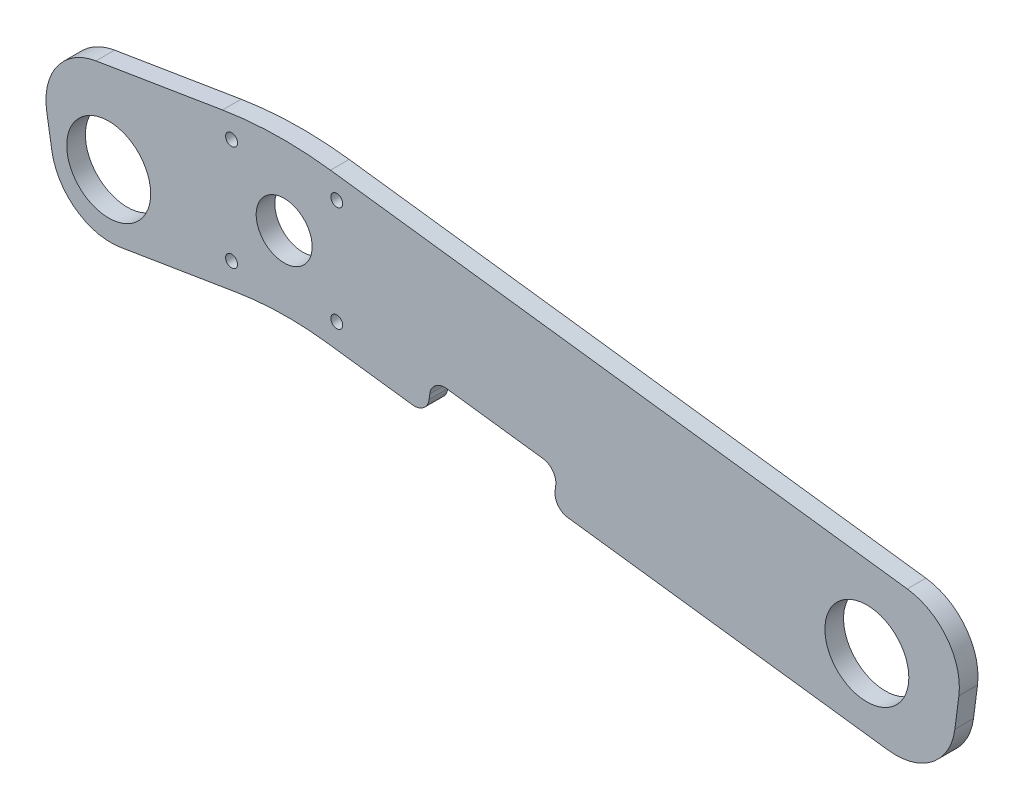
ISO-10303-21;
HEADER;
FILE_DESCRIPTION(('STEP AP214'),'2;1');
FILE_NAME('part.step','',(''),(''),'','','');
FILE_SCHEMA(('AUTOMOTIVE_DESIGN { 1 0 10303 214 1 1 1 1 }'));
ENDSEC;
DATA;
#1=APPLICATION_CONTEXT('core data for automotive mechanical design processes');
#2=APPLICATION_PROTOCOL_DEFINITION('international standard','automotive_design',2000,#1);
#3=PRODUCT_CONTEXT('',#1,'mechanical');
#4=PRODUCT('Part','Part','',(#3));
#5=PRODUCT_RELATED_PRODUCT_CATEGORY('part','',(#4));
#6=PRODUCT_DEFINITION_FORMATION('','',#4);
#7=PRODUCT_DEFINITION_CONTEXT('part definition',#1,'design');
#8=PRODUCT_DEFINITION('design','',#6,#7);
#9=PRODUCT_DEFINITION_SHAPE('','',#8);
#10=(LENGTH_UNIT() NAMED_UNIT(*) SI_UNIT(.MILLI.,.METRE.));
#11=(NAMED_UNIT(*) PLANE_ANGLE_UNIT() SI_UNIT($,.RADIAN.));
#12=(NAMED_UNIT(*) SI_UNIT($,.STERADIAN.) SOLID_ANGLE_UNIT());
#13=UNCERTAINTY_MEASURE_WITH_UNIT(LENGTH_MEASURE(1.E-05),#10,'distance_accuracy_value','');
#14=(GEOMETRIC_REPRESENTATION_CONTEXT(3) GLOBAL_UNCERTAINTY_ASSIGNED_CONTEXT((#13)) GLOBAL_UNIT_ASSIGNED_CONTEXT((#10,
#11,#12)) REPRESENTATION_CONTEXT('',''));
#15=CARTESIAN_POINT('',(0.,0.,0.));
#16=DIRECTION('',(0.,0.,1.));
#17=DIRECTION('',(1.,0.,0.));
#18=AXIS2_PLACEMENT_3D('',#15,#16,#17);
#19=CARTESIAN_POINT('',(-347.342471816428,-103.975661033452,6.35));
#20=DIRECTION('',(0.127692072022815,0.991813860934863,0.));
#21=DIRECTION('',(-0.991813860934863,0.127692072022815,0.));
#22=AXIS2_PLACEMENT_3D('',#19,#20,#21);
#23=PLANE('',#22);
#24=DIRECTION('',(0.991813860934863,-0.127692072022815,0.));
#25=VECTOR('',#24,1.);
#26=CARTESIAN_POINT('',(-347.342471816428,-103.975661033452,0.));
#27=LINE('',#26,#25);
#28=CARTESIAN_POINT('',(-331.859027890658,-105.969092578225,0.));
#29=VERTEX_POINT('',#28);
#30=CARTESIAN_POINT('',(-302.809602063347,-109.709090092947,0.));
#31=VERTEX_POINT('',#30);
#32=EDGE_CURVE('E342',#29,#31,#27,.T.);
#33=ORIENTED_EDGE('',*,*,#32,.T.);
#34=DIRECTION('',(0.,0.,1.));
#35=VECTOR('',#34,1.);
#36=CARTESIAN_POINT('',(-302.809602063347,-109.709090092947,6.35));
#37=LINE('',#36,#35);
#38=CARTESIAN_POINT('',(-302.809602063347,-109.709090092947,6.35));
#39=VERTEX_POINT('',#38);
#40=EDGE_CURVE('E265',#31,#39,#37,.T.);
#41=ORIENTED_EDGE('',*,*,#40,.T.);
#42=DIRECTION('',(0.991813860934863,-0.127692072022815,0.));
#43=VECTOR('',#42,1.);
#44=CARTESIAN_POINT('',(-347.342471816428,-103.975661033452,6.35));
#45=LINE('',#44,#43);
#46=CARTESIAN_POINT('',(-331.859027890658,-105.969092578225,6.35));
#47=VERTEX_POINT('',#46);
#48=EDGE_CURVE('E327',#47,#39,#45,.T.);
#49=ORIENTED_EDGE('',*,*,#48,.F.);
#50=DIRECTION('',(0.,0.,-1.));
#51=VECTOR('',#50,1.);
#52=CARTESIAN_POINT('',(-331.859027890658,-105.969092578225,0.));
#53=LINE('',#52,#51);
#54=EDGE_CURVE('E247',#47,#29,#53,.T.);
#55=ORIENTED_EDGE('',*,*,#54,.T.);
#56=EDGE_LOOP('',(#33,#41,#49,#55));
#57=FACE_BOUND('',#56,.T.);
#58=ADVANCED_FACE('F34',(#57),#23,.F.);
#59=CARTESIAN_POINT('',(-430.595798313536,-65.4640399700101,6.35));
#60=DIRECTION('',(0.986814610332769,0.161854641063473,0.));
#61=DIRECTION('',(-0.161854641063473,0.986814610332769,0.));
#62=AXIS2_PLACEMENT_3D('',#59,#60,#61);
#63=PLANE('',#62);
#64=DIRECTION('',(0.161854641063473,-0.986814610332769,0.));
#65=VECTOR('',#64,1.);
#66=CARTESIAN_POINT('',(-430.595798313536,-65.4640399700101,0.));
#67=LINE('',#66,#65);
#68=CARTESIAN_POINT('',(-427.306912007127,-85.516112851972,0.));
#69=VERTEX_POINT('',#68);
#70=CARTESIAN_POINT('',(-425.552607165953,-96.2119670880483,0.));
#71=VERTEX_POINT('',#70);
#72=EDGE_CURVE('E334',#69,#71,#67,.T.);
#73=ORIENTED_EDGE('',*,*,#72,.T.);
#74=DIRECTION('',(0.,0.,-1.));
#75=VECTOR('',#74,1.);
#76=CARTESIAN_POINT('',(-425.552607165953,-96.2119670880483,6.35));
#77=LINE('',#76,#75);
#78=CARTESIAN_POINT('',(-425.552607165953,-96.2119670880483,6.35));
#79=VERTEX_POINT('',#78);
#80=EDGE_CURVE('E221',#71,#79,#77,.F.);
#81=ORIENTED_EDGE('',*,*,#80,.T.);
#82=DIRECTION('',(0.161854641063473,-0.986814610332769,0.));
#83=VECTOR('',#82,1.);
#84=CARTESIAN_POINT('',(-430.595798313536,-65.4640399700101,6.35));
#85=LINE('',#84,#83);
#86=CARTESIAN_POINT('',(-427.306912007127,-85.516112851972,6.35));
#87=VERTEX_POINT('',#86);
#88=EDGE_CURVE('E195',#87,#79,#85,.T.);
#89=ORIENTED_EDGE('',*,*,#88,.F.);
#90=DIRECTION('',(0.,0.,-1.));
#91=VECTOR('',#90,1.);
#92=CARTESIAN_POINT('',(-427.306912007127,-85.516112851972,6.35));
#93=LINE('',#92,#91);
#94=EDGE_CURVE('E208',#87,#69,#93,.T.);
#95=ORIENTED_EDGE('',*,*,#94,.T.);
#96=EDGE_LOOP('',(#73,#81,#89,#95));
#97=FACE_BOUND('',#96,.T.);
#98=ADVANCED_FACE('F363',(#97),#63,.F.);
#99=CARTESIAN_POINT('',(-422.263720859543,-116.26403997001,6.35));
#100=DIRECTION('',(-0.161854641063474,0.986814610332769,0.));
#101=DIRECTION('',(-0.986814610332769,-0.161854641063474,0.));
#102=AXIS2_PLACEMENT_3D('',#99,#100,#101);
#103=PLANE('',#102);
#104=DIRECTION('',(0.986814610332769,0.161854641063474,0.));
#105=VECTOR('',#104,1.);
#106=CARTESIAN_POINT('',(-422.263720859543,-116.26403997001,0.));
#107=LINE('',#106,#105);
#108=CARTESIAN_POINT('',(-402.211647977582,-112.9751536636,0.));
#109=VERTEX_POINT('',#108);
#110=CARTESIAN_POINT('',(-362.747871242703,-106.502412632457,0.));
#111=VERTEX_POINT('',#110);
#112=EDGE_CURVE('E337',#109,#111,#107,.T.);
#113=ORIENTED_EDGE('',*,*,#112,.T.);
#114=DIRECTION('',(0.,0.,-1.));
#115=VECTOR('',#114,1.);
#116=CARTESIAN_POINT('',(-362.747871242703,-106.502412632457,6.35));
#117=LINE('',#116,#115);
#118=CARTESIAN_POINT('',(-362.747871242703,-106.502412632457,6.35));
#119=VERTEX_POINT('',#118);
#120=EDGE_CURVE('E250',#111,#119,#117,.F.);
#121=ORIENTED_EDGE('',*,*,#120,.T.);
#122=DIRECTION('',(0.986814610332769,0.161854641063474,0.));
#123=VECTOR('',#122,1.);
#124=CARTESIAN_POINT('',(-422.263720859543,-116.26403997001,6.35));
#125=LINE('',#124,#123);
#126=CARTESIAN_POINT('',(-402.211647977582,-112.9751536636,6.35));
#127=VERTEX_POINT('',#126);
#128=EDGE_CURVE('E199',#127,#119,#125,.T.);
#129=ORIENTED_EDGE('',*,*,#128,.F.);
#130=DIRECTION('',(0.,0.,-1.));
#131=VECTOR('',#130,1.);
#132=CARTESIAN_POINT('',(-402.211647977582,-112.9751536636,6.35));
#133=LINE('',#132,#131);
#134=EDGE_CURVE('E216',#127,#109,#133,.T.);
#135=ORIENTED_EDGE('',*,*,#134,.T.);
#136=EDGE_LOOP('',(#113,#121,#129,#135));
#137=FACE_BOUND('',#136,.T.);
#138=ADVANCED_FACE('F372',(#137),#103,.F.);
#139=CARTESIAN_POINT('',(-249.860027326933,-116.526136291965,6.35));
#140=VERTEX_POINT('',#139);
#141=CARTESIAN_POINT('',(-140.878206924617,-130.557110256044,6.35));
#142=VERTEX_POINT('',#141);
#143=EDGE_CURVE('E326',#140,#142,#45,.T.);
#144=ORIENTED_EDGE('',*,*,#143,.F.);
#145=DIRECTION('',(0.,0.,1.));
#146=VECTOR('',#145,1.);
#147=CARTESIAN_POINT('',(-249.860027326933,-116.526136291965,6.35));
#148=LINE('',#147,#146);
#149=CARTESIAN_POINT('',(-249.860027326933,-116.526136291965,0.));
#150=VERTEX_POINT('',#149);
#151=EDGE_CURVE('E261',#140,#150,#148,.F.);
#152=ORIENTED_EDGE('',*,*,#151,.T.);
#153=CARTESIAN_POINT('',(-140.878206924617,-130.557110256044,0.));
#154=VERTEX_POINT('',#153);
#155=EDGE_CURVE('E341',#150,#154,#27,.T.);
#156=ORIENTED_EDGE('',*,*,#155,.T.);
#157=DIRECTION('',(0.,0.,-1.));
#158=VECTOR('',#157,1.);
#159=CARTESIAN_POINT('',(-140.878206924617,-130.557110256044,6.35));
#160=LINE('',#159,#158);
#161=EDGE_CURVE('E242',#154,#142,#160,.F.);
#162=ORIENTED_EDGE('',*,*,#161,.T.);
#163=EDGE_LOOP('',(#144,#152,#156,#162));
#164=FACE_BOUND('',#163,.T.);
#165=ADVANCED_FACE('F465',(#164),#23,.F.);
#166=CARTESIAN_POINT('',(-120.724549270421,-133.151813159548,6.35));
#167=DIRECTION('',(-0.991813860934863,0.127692072022815,0.));
#168=DIRECTION('',(-0.127692072022815,-0.991813860934863,0.));
#169=AXIS2_PLACEMENT_3D('',#166,#167,#168);
#170=PLANE('',#169);
#171=DIRECTION('',(0.127692072022815,0.991813860934863,0.));
#172=VECTOR('',#171,1.);
#173=CARTESIAN_POINT('',(-120.724549270421,-133.151813159548,6.35));
#174=LINE('',#173,#172);
#175=CARTESIAN_POINT('',(-118.129846366917,-112.998155505351,6.35));
#176=VERTEX_POINT('',#175);
#177=CARTESIAN_POINT('',(-116.77895513407,-102.505470813744,6.35));
#178=VERTEX_POINT('',#177);
#179=EDGE_CURVE('E329',#176,#178,#174,.T.);
#180=ORIENTED_EDGE('',*,*,#179,.F.);
#181=DIRECTION('',(0.,0.,-1.));
#182=VECTOR('',#181,1.);
#183=CARTESIAN_POINT('',(-118.129846366917,-112.998155505351,6.35));
#184=LINE('',#183,#182);
#185=CARTESIAN_POINT('',(-118.129846366917,-112.998155505351,0.));
#186=VERTEX_POINT('',#185);
#187=EDGE_CURVE('E236',#176,#186,#184,.T.);
#188=ORIENTED_EDGE('',*,*,#187,.T.);
#189=DIRECTION('',(0.127692072022815,0.991813860934863,0.));
#190=VECTOR('',#189,1.);
#191=CARTESIAN_POINT('',(-120.724549270421,-133.151813159548,0.));
#192=LINE('',#191,#190);
#193=CARTESIAN_POINT('',(-116.77895513407,-102.505470813744,0.));
#194=VERTEX_POINT('',#193);
#195=EDGE_CURVE('E201',#186,#194,#192,.T.);
#196=ORIENTED_EDGE('',*,*,#195,.T.);
#197=DIRECTION('',(0.,0.,-1.));
#198=VECTOR('',#197,1.);
#199=CARTESIAN_POINT('',(-116.77895513407,-102.505470813744,6.35));
#200=LINE('',#199,#198);
#201=EDGE_CURVE('E231',#194,#178,#200,.F.);
#202=ORIENTED_EDGE('',*,*,#201,.T.);
#203=EDGE_LOOP('',(#180,#188,#196,#202));
#204=FACE_BOUND('',#203,.T.);
#205=ADVANCED_FACE('F347',(#204),#170,.F.);
#206=CARTESIAN_POINT('',(-349.134252230566,-52.1029393502204,6.35));
#207=DIRECTION('',(-0.127692072022815,-0.991813860934863,0.));
#208=DIRECTION('',(0.991813860934863,-0.127692072022815,0.));
#209=AXIS2_PLACEMENT_3D('',#206,#207,#208);
#210=PLANE('',#209);
#211=DIRECTION('',(-0.991813860934863,0.127692072022815,0.));
#212=VECTOR('',#211,1.);
#213=CARTESIAN_POINT('',(-349.134252230566,-52.1029393502204,6.35));
#214=LINE('',#213,#212);
#215=CARTESIAN_POINT('',(-134.337909884763,-79.7571102560441,6.35));
#216=VERTEX_POINT('',#215);
#217=CARTESIAN_POINT('',(-330.701580890364,-54.4760721416168,6.35));
#218=VERTEX_POINT('',#217);
#219=EDGE_CURVE('E331',#216,#218,#214,.T.);
#220=ORIENTED_EDGE('',*,*,#219,.F.);
#221=DIRECTION('',(0.,0.,-1.));
#222=VECTOR('',#221,1.);
#223=CARTESIAN_POINT('',(-134.337909884763,-79.7571102560441,6.35));
#224=LINE('',#223,#222);
#225=CARTESIAN_POINT('',(-134.337909884763,-79.7571102560441,0.));
#226=VERTEX_POINT('',#225);
#227=EDGE_CURVE('E225',#216,#226,#224,.T.);
#228=ORIENTED_EDGE('',*,*,#227,.T.);
#229=DIRECTION('',(-0.991813860934863,0.127692072022815,0.));
#230=VECTOR('',#229,1.);
#231=CARTESIAN_POINT('',(-349.134252230566,-52.1029393502204,0.));
#232=LINE('',#231,#230);
#233=CARTESIAN_POINT('',(-330.701580890364,-54.4760721416168,0.));
#234=VERTEX_POINT('',#233);
#235=EDGE_CURVE('E196',#226,#234,#232,.T.);
#236=ORIENTED_EDGE('',*,*,#235,.T.);
#237=DIRECTION('',(0.,0.,-1.));
#238=VECTOR('',#237,1.);
#239=CARTESIAN_POINT('',(-330.701580890364,-54.4760721416168,6.35));
#240=LINE('',#239,#238);
#241=EDGE_CURVE('E178',#234,#218,#240,.F.);
#242=ORIENTED_EDGE('',*,*,#241,.T.);
#243=EDGE_LOOP('',(#220,#228,#236,#242));
#244=FACE_BOUND('',#243,.T.);
#245=ADVANCED_FACE('F356',(#244),#210,.F.);
#246=CARTESIAN_POINT('',(-430.595798313536,-65.4640399700101,6.35));
#247=DIRECTION('',(0.161854641063474,-0.986814610332769,0.));
#248=DIRECTION('',(0.986814610332769,0.161854641063474,0.));
#249=AXIS2_PLACEMENT_3D('',#246,#247,#248);
#250=PLANE('',#249);
#251=DIRECTION('',(-0.986814610332769,-0.161854641063474,0.));
#252=VECTOR('',#251,1.);
#253=CARTESIAN_POINT('',(-430.595798313536,-65.4640399700101,0.));
#254=LINE('',#253,#252);
#255=CARTESIAN_POINT('',(-367.474013452323,-55.1109769680828,0.));
#256=VERTEX_POINT('',#255);
#257=CARTESIAN_POINT('',(-410.543725431574,-62.1751536636003,0.));
#258=VERTEX_POINT('',#257);
#259=EDGE_CURVE('E187',#256,#258,#254,.T.);
#260=ORIENTED_EDGE('',*,*,#259,.T.);
#261=DIRECTION('',(0.,0.,-1.));
#262=VECTOR('',#261,1.);
#263=CARTESIAN_POINT('',(-410.543725431574,-62.1751536636003,6.35));
#264=LINE('',#263,#262);
#265=CARTESIAN_POINT('',(-410.543725431574,-62.1751536636003,6.35));
#266=VERTEX_POINT('',#265);
#267=EDGE_CURVE('E212',#258,#266,#264,.F.);
#268=ORIENTED_EDGE('',*,*,#267,.T.);
#269=DIRECTION('',(-0.986814610332769,-0.161854641063474,0.));
#270=VECTOR('',#269,1.);
#271=CARTESIAN_POINT('',(-430.595798313536,-65.4640399700101,6.35));
#272=LINE('',#271,#270);
#273=CARTESIAN_POINT('',(-367.474013452323,-55.1109769680828,6.35));
#274=VERTEX_POINT('',#273);
#275=EDGE_CURVE('E190',#274,#266,#272,.T.);
#276=ORIENTED_EDGE('',*,*,#275,.F.);
#277=DIRECTION('',(0.,0.,-1.));
#278=VECTOR('',#277,1.);
#279=CARTESIAN_POINT('',(-367.474013452323,-55.1109769680828,6.35));
#280=LINE('',#279,#278);
#281=EDGE_CURVE('E176',#274,#256,#280,.T.);
#282=ORIENTED_EDGE('',*,*,#281,.T.);
#283=EDGE_LOOP('',(#260,#268,#276,#282));
#284=FACE_BOUND('',#283,.T.);
#285=ADVANCED_FACE('F186',(#284),#250,.F.);
#286=CARTESIAN_POINT('',(0.,0.,6.35));
#287=DIRECTION('',(0.,0.,1.));
#288=DIRECTION('',(1.,0.,0.));
#289=AXIS2_PLACEMENT_3D('',#286,#287,#288);
#290=PLANE('',#289);
#291=CARTESIAN_POINT('',(-406.219595957348,-92.055134427298,6.35));
#292=DIRECTION('',(0.,0.,1.));
#293=DIRECTION('',(1.,0.,0.));
#294=AXIS2_PLACEMENT_3D('',#291,#292,#293);
#295=CIRCLE('',#294,14.2875);
#296=CARTESIAN_POINT('',(-391.932095957348,-92.055134427298,6.35));
#297=VERTEX_POINT('',#296);
#298=EDGE_CURVE('E403',#297,#297,#295,.T.);
#299=ORIENTED_EDGE('',*,*,#298,.F.);
#300=EDGE_LOOP('',(#299));
#301=FACE_BOUND('',#300,.T.);
#302=CARTESIAN_POINT('',(-346.476890078115,-80.1938552943694,6.35));
#303=DIRECTION('',(0.,0.,1.));
#304=DIRECTION('',(1.,0.,0.));
#305=AXIS2_PLACEMENT_3D('',#302,#303,#304);
#306=CIRCLE('',#305,9.52500000000002);
#307=CARTESIAN_POINT('',(-336.951890078115,-80.1938552943694,6.35));
#308=VERTEX_POINT('',#307);
#309=EDGE_CURVE('E404',#308,#308,#306,.T.);
#310=ORIENTED_EDGE('',*,*,#309,.F.);
#311=EDGE_LOOP('',(#310));
#312=FACE_BOUND('',#311,.T.);
#313=CARTESIAN_POINT('',(-328.569471275414,-62.2866101302198,6.35));
#314=DIRECTION('',(0.,0.,1.));
#315=DIRECTION('',(1.,0.,0.));
#316=AXIS2_PLACEMENT_3D('',#313,#314,#315);
#317=CIRCLE('',#316,2.03199999999995);
#318=CARTESIAN_POINT('',(-326.537471275414,-62.2866101302198,6.35));
#319=VERTEX_POINT('',#318);
#320=EDGE_CURVE('E410',#319,#319,#317,.T.);
#321=ORIENTED_EDGE('',*,*,#320,.F.);
#322=EDGE_LOOP('',(#321));
#323=FACE_BOUND('',#322,.T.);
#324=CARTESIAN_POINT('',(-328.570308884173,-98.1006101204249,6.35));
#325=DIRECTION('',(0.,0.,1.));
#326=DIRECTION('',(1.,0.,0.));
#327=AXIS2_PLACEMENT_3D('',#324,#325,#326);
#328=CIRCLE('',#327,2.03199999999995);
#329=CARTESIAN_POINT('',(-326.538308884173,-98.1006101204249,6.35));
#330=VERTEX_POINT('',#329);
#331=EDGE_CURVE('E416',#330,#330,#328,.T.);
#332=ORIENTED_EDGE('',*,*,#331,.F.);
#333=EDGE_LOOP('',(#332));
#334=FACE_BOUND('',#333,.T.);
#335=CARTESIAN_POINT('',(-364.384308880816,-98.1011004683139,6.35));
#336=DIRECTION('',(0.,0.,1.));
#337=DIRECTION('',(1.,0.,0.));
#338=AXIS2_PLACEMENT_3D('',#335,#336,#337);
#339=CIRCLE('',#338,2.03199999999995);
#340=CARTESIAN_POINT('',(-362.352308880816,-98.1011004683139,6.35));
#341=VERTEX_POINT('',#340);
#342=EDGE_CURVE('E320',#341,#341,#339,.T.);
#343=ORIENTED_EDGE('',*,*,#342,.F.);
#344=EDGE_LOOP('',(#343));
#345=FACE_BOUND('',#344,.T.);
#346=CARTESIAN_POINT('',(-364.383471272057,-62.2871004683139,6.35));
#347=DIRECTION('',(0.,0.,1.));
#348=DIRECTION('',(1.,0.,0.));
#349=AXIS2_PLACEMENT_3D('',#346,#347,#348);
#350=CIRCLE('',#349,2.03199999999995);
#351=CARTESIAN_POINT('',(-362.351471272057,-62.2871004683139,6.35));
#352=VERTEX_POINT('',#351);
#353=EDGE_CURVE('E314',#352,#352,#350,.T.);
#354=ORIENTED_EDGE('',*,*,#353,.F.);
#355=EDGE_LOOP('',(#354));
#356=FACE_BOUND('',#355,.T.);
#357=ORIENTED_EDGE('',*,*,#48,.T.);
#358=CARTESIAN_POINT('',(-302.160926337471,-104.670675679397,6.35));
#359=DIRECTION('',(0.,0.,1.));
#360=DIRECTION('',(1.,0.,0.));
#361=AXIS2_PLACEMENT_3D('',#358,#359,#360);
#362=CIRCLE('',#361,5.07999999999999);
#363=CARTESIAN_POINT('',(-297.122511923922,-105.319351405273,6.35));
#364=VERTEX_POINT('',#363);
#365=EDGE_CURVE('E268',#39,#364,#362,.T.);
#366=ORIENTED_EDGE('',*,*,#365,.T.);
#367=DIRECTION('',(-0.127692072022817,-0.991813860934863,0.));
#368=VECTOR('',#367,1.);
#369=CARTESIAN_POINT('',(-296.240101936727,-98.4654689170099,6.35));
#370=LINE('',#369,#368);
#371=CARTESIAN_POINT('',(-296.888777662603,-103.503883330559,6.35));
#372=VERTEX_POINT('',#371);
#373=EDGE_CURVE('E303',#372,#364,#370,.T.);
#374=ORIENTED_EDGE('',*,*,#373,.F.);
#375=CARTESIAN_POINT('',(-291.850363249054,-104.152559056435,6.35));
#376=DIRECTION('',(0.,0.,1.));
#377=DIRECTION('',(1.,0.,0.));
#378=AXIS2_PLACEMENT_3D('',#375,#376,#377);
#379=CIRCLE('',#378,5.07999999999999);
#380=CARTESIAN_POINT('',(-291.201687523178,-99.1141446428858,6.35));
#381=VERTEX_POINT('',#380);
#382=EDGE_CURVE('E282',#372,#381,#379,.F.);
#383=ORIENTED_EDGE('',*,*,#382,.T.);
#384=DIRECTION('',(-0.991813860934863,0.127692072022815,0.));
#385=VECTOR('',#384,1.);
#386=CARTESIAN_POINT('',(-253.367356027411,-103.985163664276,6.35));
#387=LINE('',#386,#385);
#388=CARTESIAN_POINT('',(-258.40577044096,-103.336487938401,6.35));
#389=VERTEX_POINT('',#388);
#390=EDGE_CURVE('E294',#389,#381,#387,.T.);
#391=ORIENTED_EDGE('',*,*,#390,.F.);
#392=CARTESIAN_POINT('',(-259.054446166836,-108.37490235195,6.35));
#393=DIRECTION('',(0.,0.,1.));
#394=DIRECTION('',(1.,0.,0.));
#395=AXIS2_PLACEMENT_3D('',#392,#393,#394);
#396=CIRCLE('',#395,5.07999999999999);
#397=CARTESIAN_POINT('',(-254.016031753287,-109.023578077826,6.35));
#398=VERTEX_POINT('',#397);
#399=EDGE_CURVE('E42',#389,#398,#396,.F.);
#400=ORIENTED_EDGE('',*,*,#399,.T.);
#401=DIRECTION('',(0.127692072022817,0.991813860934863,0.));
#402=VECTOR('',#401,1.);
#403=CARTESIAN_POINT('',(-254.898441740482,-115.877460566089,6.35));
#404=LINE('',#403,#402);
#405=CARTESIAN_POINT('',(-254.249766014606,-110.83904615254,6.35));
#406=VERTEX_POINT('',#405);
#407=EDGE_CURVE('E304',#406,#398,#404,.T.);
#408=ORIENTED_EDGE('',*,*,#407,.F.);
#409=CARTESIAN_POINT('',(-249.211351601057,-111.487721878416,6.35));
#410=DIRECTION('',(0.,0.,1.));
#411=DIRECTION('',(1.,0.,0.));
#412=AXIS2_PLACEMENT_3D('',#409,#410,#411);
#413=CIRCLE('',#412,5.07999999999999);
#414=EDGE_CURVE('E259',#406,#140,#413,.T.);
#415=ORIENTED_EDGE('',*,*,#414,.T.);
#416=ORIENTED_EDGE('',*,*,#143,.T.);
#417=CARTESIAN_POINT('',(-138.283504021114,-110.403452601848,6.35));
#418=DIRECTION('',(0.,0.,1.));
#419=DIRECTION('',(1.,0.,0.));
#420=AXIS2_PLACEMENT_3D('',#417,#418,#419);
#421=CIRCLE('',#420,20.32);
#422=EDGE_CURVE('E245',#142,#176,#421,.T.);
#423=ORIENTED_EDGE('',*,*,#422,.T.);
#424=ORIENTED_EDGE('',*,*,#179,.T.);
#425=CARTESIAN_POINT('',(-136.932612788266,-99.9107679102406,6.35));
#426=DIRECTION('',(0.,0.,1.));
#427=DIRECTION('',(1.,0.,0.));
#428=AXIS2_PLACEMENT_3D('',#425,#426,#427);
#429=CIRCLE('',#428,20.32);
#430=EDGE_CURVE('E234',#178,#216,#429,.T.);
#431=ORIENTED_EDGE('',*,*,#430,.T.);
#432=ORIENTED_EDGE('',*,*,#219,.T.);
#433=CARTESIAN_POINT('',(-346.918474037261,-180.436432480344,6.35));
#434=DIRECTION('',(0.,0.,1.));
#435=DIRECTION('',(1.,0.,0.));
#436=AXIS2_PLACEMENT_3D('',#433,#434,#435);
#437=CIRCLE('',#436,127.);
#438=EDGE_CURVE('E206',#218,#274,#437,.T.);
#439=ORIENTED_EDGE('',*,*,#438,.T.);
#440=ORIENTED_EDGE('',*,*,#275,.T.);
#441=CARTESIAN_POINT('',(-407.254839125165,-82.2272265455622,6.35));
#442=DIRECTION('',(0.,0.,1.));
#443=DIRECTION('',(1.,0.,0.));
#444=AXIS2_PLACEMENT_3D('',#441,#442,#443);
#445=CIRCLE('',#444,20.32);
#446=EDGE_CURVE('E214',#266,#87,#445,.T.);
#447=ORIENTED_EDGE('',*,*,#446,.T.);
#448=ORIENTED_EDGE('',*,*,#88,.T.);
#449=CARTESIAN_POINT('',(-405.500534283991,-92.9230807816385,6.35));
#450=DIRECTION('',(0.,0.,1.));
#451=DIRECTION('',(1.,0.,0.));
#452=AXIS2_PLACEMENT_3D('',#449,#450,#451);
#453=CIRCLE('',#452,20.32);
#454=EDGE_CURVE('E223',#79,#127,#453,.T.);
#455=ORIENTED_EDGE('',*,*,#454,.T.);
#456=ORIENTED_EDGE('',*,*,#128,.T.);
#457=CARTESIAN_POINT('',(-345.481218134052,-211.775795262757,6.35));
#458=DIRECTION('',(0.,0.,1.));
#459=DIRECTION('',(1.,0.,0.));
#460=AXIS2_PLACEMENT_3D('',#457,#458,#459);
#461=CIRCLE('',#460,106.68);
#462=EDGE_CURVE('E254',#119,#47,#461,.F.);
#463=ORIENTED_EDGE('',*,*,#462,.T.);
#464=EDGE_LOOP('',(#357,#366,#374,#383,#391,#400,#408,#415,#416,#423,#424,#431,#432,#439,#440,
#447,#448,#455,#456,#463));
#465=FACE_BOUND('',#464,.T.);
#466=CARTESIAN_POINT('',(-148.10056280544,-105.648602819755,6.35));
#467=DIRECTION('',(0.,0.,1.));
#468=DIRECTION('',(1.,0.,0.));
#469=AXIS2_PLACEMENT_3D('',#466,#467,#468);
#470=CIRCLE('',#469,14.2875);
#471=CARTESIAN_POINT('',(-133.81306280544,-105.648602819755,6.35));
#472=VERTEX_POINT('',#471);
#473=EDGE_CURVE('E395',#472,#472,#470,.T.);
#474=ORIENTED_EDGE('',*,*,#473,.F.);
#475=EDGE_LOOP('',(#474));
#476=FACE_BOUND('',#475,.T.);
#477=ADVANCED_FACE('F299',(#301,#312,#323,#334,#345,#356,#465,#476),#290,.T.);
#478=CARTESIAN_POINT('',(0.,0.,0.));
#479=DIRECTION('',(0.,0.,1.));
#480=DIRECTION('',(1.,0.,0.));
#481=AXIS2_PLACEMENT_3D('',#478,#479,#480);
#482=PLANE('',#481);
#483=CARTESIAN_POINT('',(-406.219595957348,-92.055134427298,0.));
#484=DIRECTION('',(0.,0.,1.));
#485=DIRECTION('',(1.,0.,0.));
#486=AXIS2_PLACEMENT_3D('',#483,#484,#485);
#487=CIRCLE('',#486,14.2875);
#488=CARTESIAN_POINT('',(-391.932095957348,-92.055134427298,0.));
#489=VERTEX_POINT('',#488);
#490=EDGE_CURVE('E338',#489,#489,#487,.T.);
#491=ORIENTED_EDGE('',*,*,#490,.T.);
#492=EDGE_LOOP('',(#491));
#493=FACE_BOUND('',#492,.T.);
#494=CARTESIAN_POINT('',(-346.476890078115,-80.1938552943694,0.));
#495=DIRECTION('',(0.,0.,1.));
#496=DIRECTION('',(1.,0.,0.));
#497=AXIS2_PLACEMENT_3D('',#494,#495,#496);
#498=CIRCLE('',#497,9.52500000000002);
#499=CARTESIAN_POINT('',(-336.951890078115,-80.1938552943694,0.));
#500=VERTEX_POINT('',#499);
#501=EDGE_CURVE('E407',#500,#500,#498,.T.);
#502=ORIENTED_EDGE('',*,*,#501,.T.);
#503=EDGE_LOOP('',(#502));
#504=FACE_BOUND('',#503,.T.);
#505=CARTESIAN_POINT('',(-328.569471275414,-62.2866101302198,0.));
#506=DIRECTION('',(0.,0.,1.));
#507=DIRECTION('',(1.,0.,0.));
#508=AXIS2_PLACEMENT_3D('',#505,#506,#507);
#509=CIRCLE('',#508,2.03199999999995);
#510=CARTESIAN_POINT('',(-326.537471275414,-62.2866101302198,0.));
#511=VERTEX_POINT('',#510);
#512=EDGE_CURVE('E413',#511,#511,#509,.T.);
#513=ORIENTED_EDGE('',*,*,#512,.T.);
#514=EDGE_LOOP('',(#513));
#515=FACE_BOUND('',#514,.T.);
#516=CARTESIAN_POINT('',(-328.570308884173,-98.1006101204249,0.));
#517=DIRECTION('',(0.,0.,1.));
#518=DIRECTION('',(1.,0.,0.));
#519=AXIS2_PLACEMENT_3D('',#516,#517,#518);
#520=CIRCLE('',#519,2.03199999999995);
#521=CARTESIAN_POINT('',(-326.538308884173,-98.1006101204249,0.));
#522=VERTEX_POINT('',#521);
#523=EDGE_CURVE('E322',#522,#522,#520,.T.);
#524=ORIENTED_EDGE('',*,*,#523,.T.);
#525=EDGE_LOOP('',(#524));
#526=FACE_BOUND('',#525,.T.);
#527=CARTESIAN_POINT('',(-364.384308880816,-98.1011004683139,0.));
#528=DIRECTION('',(0.,0.,1.));
#529=DIRECTION('',(1.,0.,0.));
#530=AXIS2_PLACEMENT_3D('',#527,#528,#529);
#531=CIRCLE('',#530,2.03199999999995);
#532=CARTESIAN_POINT('',(-362.352308880816,-98.1011004683139,0.));
#533=VERTEX_POINT('',#532);
#534=EDGE_CURVE('E317',#533,#533,#531,.T.);
#535=ORIENTED_EDGE('',*,*,#534,.T.);
#536=EDGE_LOOP('',(#535));
#537=FACE_BOUND('',#536,.T.);
#538=CARTESIAN_POINT('',(-364.383471272057,-62.2871004683139,0.));
#539=DIRECTION('',(0.,0.,1.));
#540=DIRECTION('',(1.,0.,0.));
#541=AXIS2_PLACEMENT_3D('',#538,#539,#540);
#542=CIRCLE('',#541,2.03199999999995);
#543=CARTESIAN_POINT('',(-362.351471272057,-62.2871004683139,0.));
#544=VERTEX_POINT('',#543);
#545=EDGE_CURVE('E308',#544,#544,#542,.T.);
#546=ORIENTED_EDGE('',*,*,#545,.T.);
#547=EDGE_LOOP('',(#546));
#548=FACE_BOUND('',#547,.T.);
#549=CARTESIAN_POINT('',(-148.10056280544,-105.648602819755,0.));
#550=DIRECTION('',(0.,0.,1.));
#551=DIRECTION('',(1.,0.,0.));
#552=AXIS2_PLACEMENT_3D('',#549,#550,#551);
#553=CIRCLE('',#552,14.2875);
#554=CARTESIAN_POINT('',(-133.81306280544,-105.648602819755,0.));
#555=VERTEX_POINT('',#554);
#556=EDGE_CURVE('E400',#555,#555,#553,.T.);
#557=ORIENTED_EDGE('',*,*,#556,.T.);
#558=EDGE_LOOP('',(#557));
#559=FACE_BOUND('',#558,.T.);
#560=DIRECTION('',(0.127692072022817,0.991813860934863,0.));
#561=VECTOR('',#560,1.);
#562=CARTESIAN_POINT('',(-254.898441740482,-115.877460566089,0.));
#563=LINE('',#562,#561);
#564=CARTESIAN_POINT('',(-254.249766014606,-110.83904615254,0.));
#565=VERTEX_POINT('',#564);
#566=CARTESIAN_POINT('',(-254.016031753287,-109.023578077826,0.));
#567=VERTEX_POINT('',#566);
#568=EDGE_CURVE('E306',#565,#567,#563,.T.);
#569=ORIENTED_EDGE('',*,*,#568,.T.);
#570=CARTESIAN_POINT('',(-259.054446166836,-108.37490235195,0.));
#571=DIRECTION('',(0.,0.,1.));
#572=DIRECTION('',(1.,0.,0.));
#573=AXIS2_PLACEMENT_3D('',#570,#571,#572);
#574=CIRCLE('',#573,5.07999999999999);
#575=CARTESIAN_POINT('',(-258.40577044096,-103.336487938401,0.));
#576=VERTEX_POINT('',#575);
#577=EDGE_CURVE('E11',#567,#576,#574,.T.);
#578=ORIENTED_EDGE('',*,*,#577,.T.);
#579=DIRECTION('',(-0.991813860934863,0.127692072022815,0.));
#580=VECTOR('',#579,1.);
#581=CARTESIAN_POINT('',(-253.367356027411,-103.985163664276,0.));
#582=LINE('',#581,#580);
#583=CARTESIAN_POINT('',(-291.201687523178,-99.1141446428858,0.));
#584=VERTEX_POINT('',#583);
#585=EDGE_CURVE('E295',#576,#584,#582,.T.);
#586=ORIENTED_EDGE('',*,*,#585,.T.);
#587=CARTESIAN_POINT('',(-291.850363249054,-104.152559056435,0.));
#588=DIRECTION('',(0.,0.,1.));
#589=DIRECTION('',(1.,0.,0.));
#590=AXIS2_PLACEMENT_3D('',#587,#588,#589);
#591=CIRCLE('',#590,5.07999999999999);
#592=CARTESIAN_POINT('',(-296.888777662603,-103.503883330559,0.));
#593=VERTEX_POINT('',#592);
#594=EDGE_CURVE('E285',#584,#593,#591,.T.);
#595=ORIENTED_EDGE('',*,*,#594,.T.);
#596=DIRECTION('',(-0.127692072022817,-0.991813860934863,0.));
#597=VECTOR('',#596,1.);
#598=CARTESIAN_POINT('',(-296.240101936727,-98.4654689170099,0.));
#599=LINE('',#598,#597);
#600=CARTESIAN_POINT('',(-297.122511923922,-105.319351405273,0.));
#601=VERTEX_POINT('',#600);
#602=EDGE_CURVE('E384',#593,#601,#599,.T.);
#603=ORIENTED_EDGE('',*,*,#602,.T.);
#604=CARTESIAN_POINT('',(-302.160926337471,-104.670675679397,0.));
#605=DIRECTION('',(0.,0.,1.));
#606=DIRECTION('',(1.,0.,0.));
#607=AXIS2_PLACEMENT_3D('',#604,#605,#606);
#608=CIRCLE('',#607,5.07999999999999);
#609=EDGE_CURVE('E274',#601,#31,#608,.F.);
#610=ORIENTED_EDGE('',*,*,#609,.T.);
#611=ORIENTED_EDGE('',*,*,#32,.F.);
#612=CARTESIAN_POINT('',(-345.481218134052,-211.775795262757,0.));
#613=DIRECTION('',(0.,0.,1.));
#614=DIRECTION('',(1.,0.,0.));
#615=AXIS2_PLACEMENT_3D('',#612,#613,#614);
#616=CIRCLE('',#615,106.68);
#617=EDGE_CURVE('E252',#29,#111,#616,.T.);
#618=ORIENTED_EDGE('',*,*,#617,.T.);
#619=ORIENTED_EDGE('',*,*,#112,.F.);
#620=CARTESIAN_POINT('',(-405.500534283991,-92.9230807816385,0.));
#621=DIRECTION('',(0.,0.,1.));
#622=DIRECTION('',(1.,0.,0.));
#623=AXIS2_PLACEMENT_3D('',#620,#621,#622);
#624=CIRCLE('',#623,20.32);
#625=EDGE_CURVE('E219',#109,#71,#624,.F.);
#626=ORIENTED_EDGE('',*,*,#625,.T.);
#627=ORIENTED_EDGE('',*,*,#72,.F.);
#628=CARTESIAN_POINT('',(-407.254839125165,-82.2272265455622,0.));
#629=DIRECTION('',(0.,0.,1.));
#630=DIRECTION('',(1.,0.,0.));
#631=AXIS2_PLACEMENT_3D('',#628,#629,#630);
#632=CIRCLE('',#631,20.32);
#633=EDGE_CURVE('E194',#69,#258,#632,.F.);
#634=ORIENTED_EDGE('',*,*,#633,.T.);
#635=ORIENTED_EDGE('',*,*,#259,.F.);
#636=CARTESIAN_POINT('',(-346.918474037261,-180.436432480344,0.));
#637=DIRECTION('',(0.,0.,1.));
#638=DIRECTION('',(1.,0.,0.));
#639=AXIS2_PLACEMENT_3D('',#636,#637,#638);
#640=CIRCLE('',#639,127.);
#641=EDGE_CURVE('E172',#256,#234,#640,.F.);
#642=ORIENTED_EDGE('',*,*,#641,.T.);
#643=ORIENTED_EDGE('',*,*,#235,.F.);
#644=CARTESIAN_POINT('',(-136.932612788266,-99.9107679102406,0.));
#645=DIRECTION('',(0.,0.,1.));
#646=DIRECTION('',(1.,0.,0.));
#647=AXIS2_PLACEMENT_3D('',#644,#645,#646);
#648=CIRCLE('',#647,20.32);
#649=EDGE_CURVE('E228',#226,#194,#648,.F.);
#650=ORIENTED_EDGE('',*,*,#649,.T.);
#651=ORIENTED_EDGE('',*,*,#195,.F.);
#652=CARTESIAN_POINT('',(-138.283504021114,-110.403452601848,0.));
#653=DIRECTION('',(0.,0.,1.));
#654=DIRECTION('',(1.,0.,0.));
#655=AXIS2_PLACEMENT_3D('',#652,#653,#654);
#656=CIRCLE('',#655,20.32);
#657=EDGE_CURVE('E239',#186,#154,#656,.F.);
#658=ORIENTED_EDGE('',*,*,#657,.T.);
#659=ORIENTED_EDGE('',*,*,#155,.F.);
#660=CARTESIAN_POINT('',(-249.211351601057,-111.487721878416,0.));
#661=DIRECTION('',(0.,0.,1.));
#662=DIRECTION('',(1.,0.,0.));
#663=AXIS2_PLACEMENT_3D('',#660,#661,#662);
#664=CIRCLE('',#663,5.07999999999999);
#665=EDGE_CURVE('E263',#150,#565,#664,.F.);
#666=ORIENTED_EDGE('',*,*,#665,.T.);
#667=EDGE_LOOP('',(#569,#578,#586,#595,#603,#610,#611,#618,#619,#626,#627,#634,#635,#642,#643,
#650,#651,#658,#659,#666));
#668=FACE_BOUND('',#667,.T.);
#669=ADVANCED_FACE('F192',(#493,#504,#515,#526,#537,#548,#559,#668),#482,.F.);
#670=CARTESIAN_POINT('',(-148.10056280544,-105.648602819755,0.));
#671=DIRECTION('',(0.,0.,1.));
#672=DIRECTION('',(1.,0.,0.));
#673=AXIS2_PLACEMENT_3D('',#670,#671,#672);
#674=CYLINDRICAL_SURFACE('',#673,14.2875);
#675=ORIENTED_EDGE('',*,*,#556,.F.);
#676=EDGE_LOOP('',(#675));
#677=FACE_BOUND('',#676,.T.);
#678=ORIENTED_EDGE('',*,*,#473,.T.);
#679=EDGE_LOOP('',(#678));
#680=FACE_BOUND('',#679,.T.);
#681=ADVANCED_FACE('F560',(#677,#680),#674,.F.);
#682=CARTESIAN_POINT('',(-296.240101936727,-98.4654689170099,0.));
#683=DIRECTION('',(-0.991813860934863,0.127692072022817,0.));
#684=DIRECTION('',(-0.127692072022817,-0.991813860934863,0.));
#685=AXIS2_PLACEMENT_3D('',#682,#683,#684);
#686=PLANE('',#685);
#687=ORIENTED_EDGE('',*,*,#602,.F.);
#688=DIRECTION('',(0.,0.,1.));
#689=VECTOR('',#688,1.);
#690=CARTESIAN_POINT('',(-296.888777662603,-103.503883330559,6.35));
#691=LINE('',#690,#689);
#692=EDGE_CURVE('E276',#593,#372,#691,.T.);
#693=ORIENTED_EDGE('',*,*,#692,.T.);
#694=ORIENTED_EDGE('',*,*,#373,.T.);
#695=DIRECTION('',(0.,0.,1.));
#696=VECTOR('',#695,1.);
#697=CARTESIAN_POINT('',(-297.122511923922,-105.319351405273,0.));
#698=LINE('',#697,#696);
#699=EDGE_CURVE('E271',#364,#601,#698,.F.);
#700=ORIENTED_EDGE('',*,*,#699,.T.);
#701=EDGE_LOOP('',(#687,#693,#694,#700));
#702=FACE_BOUND('',#701,.T.);
#703=ADVANCED_FACE('F389',(#702),#686,.F.);
#704=CARTESIAN_POINT('',(-253.367356027411,-103.985163664276,0.));
#705=DIRECTION('',(0.127692072022815,0.991813860934863,0.));
#706=DIRECTION('',(-0.991813860934863,0.127692072022815,0.));
#707=AXIS2_PLACEMENT_3D('',#704,#705,#706);
#708=PLANE('',#707);
#709=ORIENTED_EDGE('',*,*,#585,.F.);
#710=DIRECTION('',(0.,0.,1.));
#711=VECTOR('',#710,1.);
#712=CARTESIAN_POINT('',(-258.40577044096,-103.336487938401,6.35));
#713=LINE('',#712,#711);
#714=EDGE_CURVE('E287',#576,#389,#713,.T.);
#715=ORIENTED_EDGE('',*,*,#714,.T.);
#716=ORIENTED_EDGE('',*,*,#390,.T.);
#717=DIRECTION('',(0.,0.,1.));
#718=VECTOR('',#717,1.);
#719=CARTESIAN_POINT('',(-291.201687523178,-99.1141446428858,0.));
#720=LINE('',#719,#718);
#721=EDGE_CURVE('E279',#381,#584,#720,.F.);
#722=ORIENTED_EDGE('',*,*,#721,.T.);
#723=EDGE_LOOP('',(#709,#715,#716,#722));
#724=FACE_BOUND('',#723,.T.);
#725=ADVANCED_FACE('F293',(#724),#708,.F.);
#726=CARTESIAN_POINT('',(-254.898441740482,-115.877460566089,0.));
#727=DIRECTION('',(0.991813860934863,-0.127692072022817,0.));
#728=DIRECTION('',(0.127692072022817,0.991813860934863,0.));
#729=AXIS2_PLACEMENT_3D('',#726,#727,#728);
#730=PLANE('',#729);
#731=ORIENTED_EDGE('',*,*,#407,.T.);
#732=DIRECTION('',(0.,0.,1.));
#733=VECTOR('',#732,1.);
#734=CARTESIAN_POINT('',(-254.016031753287,-109.023578077826,0.));
#735=LINE('',#734,#733);
#736=EDGE_CURVE('E55',#398,#567,#735,.F.);
#737=ORIENTED_EDGE('',*,*,#736,.T.);
#738=ORIENTED_EDGE('',*,*,#568,.F.);
#739=DIRECTION('',(0.,0.,1.));
#740=VECTOR('',#739,1.);
#741=CARTESIAN_POINT('',(-254.249766014606,-110.83904615254,0.));
#742=LINE('',#741,#740);
#743=EDGE_CURVE('E256',#565,#406,#742,.T.);
#744=ORIENTED_EDGE('',*,*,#743,.T.);
#745=EDGE_LOOP('',(#731,#737,#738,#744));
#746=FACE_BOUND('',#745,.T.);
#747=ADVANCED_FACE('F451',(#746),#730,.F.);
#748=CARTESIAN_POINT('',(-364.383471272057,-62.2871004683139,0.));
#749=DIRECTION('',(0.,0.,1.));
#750=DIRECTION('',(1.,0.,0.));
#751=AXIS2_PLACEMENT_3D('',#748,#749,#750);
#752=CYLINDRICAL_SURFACE('',#751,2.03199999999995);
#753=ORIENTED_EDGE('',*,*,#545,.F.);
#754=EDGE_LOOP('',(#753));
#755=FACE_BOUND('',#754,.T.);
#756=ORIENTED_EDGE('',*,*,#353,.T.);
#757=EDGE_LOOP('',(#756));
#758=FACE_BOUND('',#757,.T.);
#759=ADVANCED_FACE('F448',(#755,#758),#752,.F.);
#760=CARTESIAN_POINT('',(-364.384308880816,-98.1011004683139,0.));
#761=DIRECTION('',(0.,0.,1.));
#762=DIRECTION('',(1.,0.,0.));
#763=AXIS2_PLACEMENT_3D('',#760,#761,#762);
#764=CYLINDRICAL_SURFACE('',#763,2.03199999999995);
#765=ORIENTED_EDGE('',*,*,#534,.F.);
#766=EDGE_LOOP('',(#765));
#767=FACE_BOUND('',#766,.T.);
#768=ORIENTED_EDGE('',*,*,#342,.T.);
#769=EDGE_LOOP('',(#768));
#770=FACE_BOUND('',#769,.T.);
#771=ADVANCED_FACE('F450',(#767,#770),#764,.F.);
#772=CARTESIAN_POINT('',(-328.570308884173,-98.1006101204249,0.));
#773=DIRECTION('',(0.,0.,1.));
#774=DIRECTION('',(1.,0.,0.));
#775=AXIS2_PLACEMENT_3D('',#772,#773,#774);
#776=CYLINDRICAL_SURFACE('',#775,2.03199999999995);
#777=ORIENTED_EDGE('',*,*,#523,.F.);
#778=EDGE_LOOP('',(#777));
#779=FACE_BOUND('',#778,.T.);
#780=ORIENTED_EDGE('',*,*,#331,.T.);
#781=EDGE_LOOP('',(#780));
#782=FACE_BOUND('',#781,.T.);
#783=ADVANCED_FACE('F458',(#779,#782),#776,.F.);
#784=CARTESIAN_POINT('',(-328.569471275414,-62.2866101302198,0.));
#785=DIRECTION('',(0.,0.,1.));
#786=DIRECTION('',(1.,0.,0.));
#787=AXIS2_PLACEMENT_3D('',#784,#785,#786);
#788=CYLINDRICAL_SURFACE('',#787,2.03199999999995);
#789=ORIENTED_EDGE('',*,*,#512,.F.);
#790=EDGE_LOOP('',(#789));
#791=FACE_BOUND('',#790,.T.);
#792=ORIENTED_EDGE('',*,*,#320,.T.);
#793=EDGE_LOOP('',(#792));
#794=FACE_BOUND('',#793,.T.);
#795=ADVANCED_FACE('F620',(#791,#794),#788,.F.);
#796=CARTESIAN_POINT('',(-346.476890078115,-80.1938552943694,0.));
#797=DIRECTION('',(0.,0.,1.));
#798=DIRECTION('',(1.,0.,0.));
#799=AXIS2_PLACEMENT_3D('',#796,#797,#798);
#800=CYLINDRICAL_SURFACE('',#799,9.52500000000002);
#801=ORIENTED_EDGE('',*,*,#501,.F.);
#802=EDGE_LOOP('',(#801));
#803=FACE_BOUND('',#802,.T.);
#804=ORIENTED_EDGE('',*,*,#309,.T.);
#805=EDGE_LOOP('',(#804));
#806=FACE_BOUND('',#805,.T.);
#807=ADVANCED_FACE('F431',(#803,#806),#800,.F.);
#808=CARTESIAN_POINT('',(-406.219595957348,-92.055134427298,0.));
#809=DIRECTION('',(0.,0.,1.));
#810=DIRECTION('',(1.,0.,0.));
#811=AXIS2_PLACEMENT_3D('',#808,#809,#810);
#812=CYLINDRICAL_SURFACE('',#811,14.2875);
#813=ORIENTED_EDGE('',*,*,#490,.F.);
#814=EDGE_LOOP('',(#813));
#815=FACE_BOUND('',#814,.T.);
#816=ORIENTED_EDGE('',*,*,#298,.T.);
#817=EDGE_LOOP('',(#816));
#818=FACE_BOUND('',#817,.T.);
#819=ADVANCED_FACE('F428',(#815,#818),#812,.F.);
#820=CARTESIAN_POINT('',(-346.918474037261,-180.436432480344,6.35));
#821=DIRECTION('',(0.,0.,-1.));
#822=DIRECTION('',(-1.,0.,0.));
#823=AXIS2_PLACEMENT_3D('',#820,#821,#822);
#824=CYLINDRICAL_SURFACE('',#823,127.);
#825=ORIENTED_EDGE('',*,*,#438,.F.);
#826=ORIENTED_EDGE('',*,*,#241,.F.);
#827=ORIENTED_EDGE('',*,*,#641,.F.);
#828=ORIENTED_EDGE('',*,*,#281,.F.);
#829=EDGE_LOOP('',(#825,#826,#827,#828));
#830=FACE_BOUND('',#829,.T.);
#831=ADVANCED_FACE('F175',(#830),#824,.T.);
#832=CARTESIAN_POINT('',(-407.254839125165,-82.2272265455622,6.35));
#833=DIRECTION('',(0.,0.,-1.));
#834=DIRECTION('',(-1.,0.,0.));
#835=AXIS2_PLACEMENT_3D('',#832,#833,#834);
#836=CYLINDRICAL_SURFACE('',#835,20.32);
#837=ORIENTED_EDGE('',*,*,#446,.F.);
#838=ORIENTED_EDGE('',*,*,#267,.F.);
#839=ORIENTED_EDGE('',*,*,#633,.F.);
#840=ORIENTED_EDGE('',*,*,#94,.F.);
#841=EDGE_LOOP('',(#837,#838,#839,#840));
#842=FACE_BOUND('',#841,.T.);
#843=ADVANCED_FACE('F361',(#842),#836,.T.);
#844=CARTESIAN_POINT('',(-405.500534283991,-92.9230807816385,6.35));
#845=DIRECTION('',(0.,0.,-1.));
#846=DIRECTION('',(-1.,0.,0.));
#847=AXIS2_PLACEMENT_3D('',#844,#845,#846);
#848=CYLINDRICAL_SURFACE('',#847,20.32);
#849=ORIENTED_EDGE('',*,*,#454,.F.);
#850=ORIENTED_EDGE('',*,*,#80,.F.);
#851=ORIENTED_EDGE('',*,*,#625,.F.);
#852=ORIENTED_EDGE('',*,*,#134,.F.);
#853=EDGE_LOOP('',(#849,#850,#851,#852));
#854=FACE_BOUND('',#853,.T.);
#855=ADVANCED_FACE('F369',(#854),#848,.T.);
#856=CARTESIAN_POINT('',(-136.932612788266,-99.9107679102406,6.35));
#857=DIRECTION('',(0.,0.,-1.));
#858=DIRECTION('',(-1.,0.,0.));
#859=AXIS2_PLACEMENT_3D('',#856,#857,#858);
#860=CYLINDRICAL_SURFACE('',#859,20.32);
#861=ORIENTED_EDGE('',*,*,#430,.F.);
#862=ORIENTED_EDGE('',*,*,#201,.F.);
#863=ORIENTED_EDGE('',*,*,#649,.F.);
#864=ORIENTED_EDGE('',*,*,#227,.F.);
#865=EDGE_LOOP('',(#861,#862,#863,#864));
#866=FACE_BOUND('',#865,.T.);
#867=ADVANCED_FACE('F353',(#866),#860,.T.);
#868=CARTESIAN_POINT('',(-138.283504021114,-110.403452601848,6.35));
#869=DIRECTION('',(0.,0.,-1.));
#870=DIRECTION('',(-1.,0.,0.));
#871=AXIS2_PLACEMENT_3D('',#868,#869,#870);
#872=CYLINDRICAL_SURFACE('',#871,20.32);
#873=ORIENTED_EDGE('',*,*,#422,.F.);
#874=ORIENTED_EDGE('',*,*,#161,.F.);
#875=ORIENTED_EDGE('',*,*,#657,.F.);
#876=ORIENTED_EDGE('',*,*,#187,.F.);
#877=EDGE_LOOP('',(#873,#874,#875,#876));
#878=FACE_BOUND('',#877,.T.);
#879=ADVANCED_FACE('F500',(#878),#872,.T.);
#880=CARTESIAN_POINT('',(-345.481218134052,-211.775795262757,6.35));
#881=DIRECTION('',(0.,0.,1.));
#882=DIRECTION('',(1.,0.,0.));
#883=AXIS2_PLACEMENT_3D('',#880,#881,#882);
#884=CYLINDRICAL_SURFACE('',#883,106.68);
#885=ORIENTED_EDGE('',*,*,#462,.F.);
#886=ORIENTED_EDGE('',*,*,#120,.F.);
#887=ORIENTED_EDGE('',*,*,#617,.F.);
#888=ORIENTED_EDGE('',*,*,#54,.F.);
#889=EDGE_LOOP('',(#885,#886,#887,#888));
#890=FACE_BOUND('',#889,.T.);
#891=ADVANCED_FACE('F378',(#890),#884,.F.);
#892=CARTESIAN_POINT('',(-249.211351601057,-111.487721878416,0.));
#893=DIRECTION('',(0.,0.,1.));
#894=DIRECTION('',(1.,0.,0.));
#895=AXIS2_PLACEMENT_3D('',#892,#893,#894);
#896=CYLINDRICAL_SURFACE('',#895,5.07999999999999);
#897=ORIENTED_EDGE('',*,*,#665,.F.);
#898=ORIENTED_EDGE('',*,*,#151,.F.);
#899=ORIENTED_EDGE('',*,*,#414,.F.);
#900=ORIENTED_EDGE('',*,*,#743,.F.);
#901=EDGE_LOOP('',(#897,#898,#899,#900));
#902=FACE_BOUND('',#901,.T.);
#903=ADVANCED_FACE('F485',(#902),#896,.T.);
#904=CARTESIAN_POINT('',(-302.160926337471,-104.670675679397,6.35));
#905=DIRECTION('',(0.,0.,1.));
#906=DIRECTION('',(1.,0.,0.));
#907=AXIS2_PLACEMENT_3D('',#904,#905,#906);
#908=CYLINDRICAL_SURFACE('',#907,5.07999999999999);
#909=ORIENTED_EDGE('',*,*,#609,.F.);
#910=ORIENTED_EDGE('',*,*,#699,.F.);
#911=ORIENTED_EDGE('',*,*,#365,.F.);
#912=ORIENTED_EDGE('',*,*,#40,.F.);
#913=EDGE_LOOP('',(#909,#910,#911,#912));
#914=FACE_BOUND('',#913,.T.);
#915=ADVANCED_FACE('F387',(#914),#908,.T.);
#916=CARTESIAN_POINT('',(-291.850363249054,-104.152559056435,0.));
#917=DIRECTION('',(0.,0.,-1.));
#918=DIRECTION('',(-1.,0.,0.));
#919=AXIS2_PLACEMENT_3D('',#916,#917,#918);
#920=CYLINDRICAL_SURFACE('',#919,5.07999999999999);
#921=ORIENTED_EDGE('',*,*,#594,.F.);
#922=ORIENTED_EDGE('',*,*,#721,.F.);
#923=ORIENTED_EDGE('',*,*,#382,.F.);
#924=ORIENTED_EDGE('',*,*,#692,.F.);
#925=EDGE_LOOP('',(#921,#922,#923,#924));
#926=FACE_BOUND('',#925,.T.);
#927=ADVANCED_FACE('F393',(#926),#920,.F.);
#928=CARTESIAN_POINT('',(-259.054446166836,-108.37490235195,0.));
#929=DIRECTION('',(0.,0.,-1.));
#930=DIRECTION('',(-1.,0.,0.));
#931=AXIS2_PLACEMENT_3D('',#928,#929,#930);
#932=CYLINDRICAL_SURFACE('',#931,5.07999999999999);
#933=ORIENTED_EDGE('',*,*,#577,.F.);
#934=ORIENTED_EDGE('',*,*,#736,.F.);
#935=ORIENTED_EDGE('',*,*,#399,.F.);
#936=ORIENTED_EDGE('',*,*,#714,.F.);
#937=EDGE_LOOP('',(#933,#934,#935,#936));
#938=FACE_BOUND('',#937,.T.);
#939=ADVANCED_FACE('F36',(#938),#932,.F.);
#940=CLOSED_SHELL('',(#58,#98,#138,#165,#205,#245,#285,#477,#669,#681,#703,#725,#747,#759,#771,
#783,#795,#807,#819,#831,#843,#855,#867,#879,#891,#903,#915,#927,#939));
#941=MANIFOLD_SOLID_BREP('B2',#940);
#942=ADVANCED_BREP_SHAPE_REPRESENTATION('',(#18,#941),#14);
#943=SHAPE_DEFINITION_REPRESENTATION(#9,#942);
ENDSEC;
END-ISO-10303-21;
